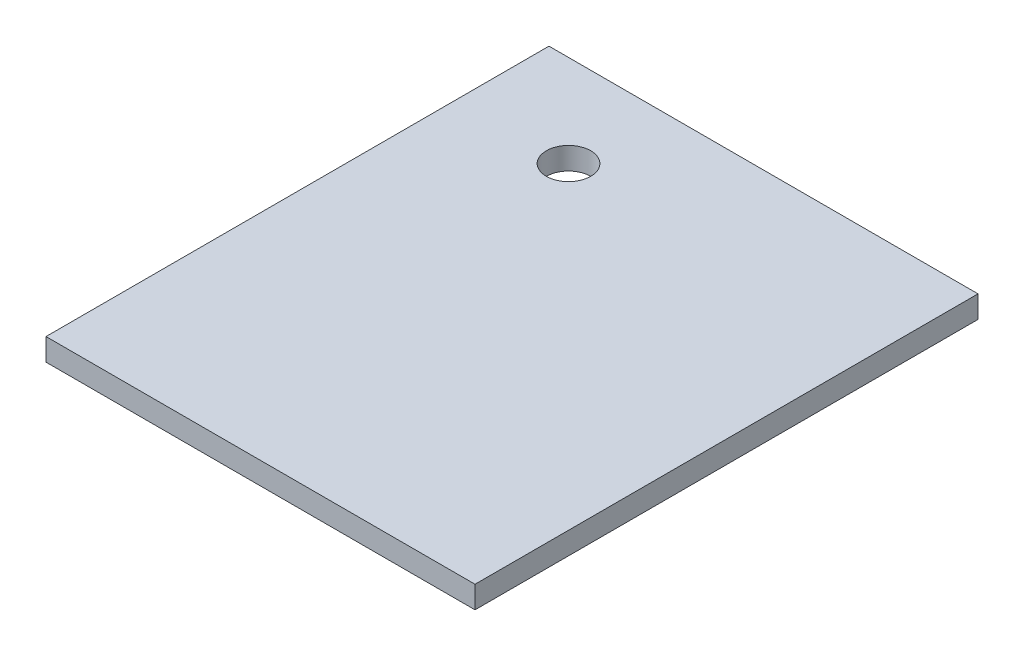
ISO-10303-21;
HEADER;
FILE_DESCRIPTION(('STEP AP214'),'2;1');
FILE_NAME('part.step','',(''),(''),'','','');
FILE_SCHEMA(('AUTOMOTIVE_DESIGN { 1 0 10303 214 1 1 1 1 }'));
ENDSEC;
DATA;
#1=APPLICATION_CONTEXT('core data for automotive mechanical design processes');
#2=APPLICATION_PROTOCOL_DEFINITION('international standard','automotive_design',2000,#1);
#3=PRODUCT_CONTEXT('',#1,'mechanical');
#4=PRODUCT('Part','Part','',(#3));
#5=PRODUCT_RELATED_PRODUCT_CATEGORY('part','',(#4));
#6=PRODUCT_DEFINITION_FORMATION('','',#4);
#7=PRODUCT_DEFINITION_CONTEXT('part definition',#1,'design');
#8=PRODUCT_DEFINITION('design','',#6,#7);
#9=PRODUCT_DEFINITION_SHAPE('','',#8);
#10=(LENGTH_UNIT() NAMED_UNIT(*) SI_UNIT(.MILLI.,.METRE.));
#11=(NAMED_UNIT(*) PLANE_ANGLE_UNIT() SI_UNIT($,.RADIAN.));
#12=(NAMED_UNIT(*) SI_UNIT($,.STERADIAN.) SOLID_ANGLE_UNIT());
#13=UNCERTAINTY_MEASURE_WITH_UNIT(LENGTH_MEASURE(1.E-05),#10,'distance_accuracy_value','');
#14=(GEOMETRIC_REPRESENTATION_CONTEXT(3) GLOBAL_UNCERTAINTY_ASSIGNED_CONTEXT((#13)) GLOBAL_UNIT_ASSIGNED_CONTEXT((#10,
#11,#12)) REPRESENTATION_CONTEXT('',''));
#15=CARTESIAN_POINT('',(0.,0.,0.));
#16=DIRECTION('',(0.,0.,1.));
#17=DIRECTION('',(1.,0.,0.));
#18=AXIS2_PLACEMENT_3D('',#15,#16,#17);
#19=CARTESIAN_POINT('',(-26.3685789469399,3.,-11.4411281551357));
#20=DIRECTION('',(1.,0.,0.));
#21=DIRECTION('',(0.,0.,-1.));
#22=AXIS2_PLACEMENT_3D('',#19,#20,#21);
#23=PLANE('',#22);
#24=DIRECTION('',(0.,0.,1.));
#25=VECTOR('',#24,1.);
#26=CARTESIAN_POINT('',(-26.3685789469399,0.,-11.4411281551357));
#27=LINE('',#26,#25);
#28=CARTESIAN_POINT('',(-26.3685789469399,0.,-11.4411281551357));
#29=VERTEX_POINT('',#28);
#30=CARTESIAN_POINT('',(-26.3685789469398,0.,56.5588718448644));
#31=VERTEX_POINT('',#30);
#32=EDGE_CURVE('E101',#29,#31,#27,.T.);
#33=ORIENTED_EDGE('',*,*,#32,.T.);
#34=DIRECTION('',(0.,-1.,0.));
#35=VECTOR('',#34,1.);
#36=CARTESIAN_POINT('',(-26.3685789469398,3.,56.5588718448644));
#37=LINE('',#36,#35);
#38=CARTESIAN_POINT('',(-26.3685789469398,3.,56.5588718448644));
#39=VERTEX_POINT('',#38);
#40=EDGE_CURVE('E11',#39,#31,#37,.T.);
#41=ORIENTED_EDGE('',*,*,#40,.F.);
#42=DIRECTION('',(0.,0.,1.));
#43=VECTOR('',#42,1.);
#44=CARTESIAN_POINT('',(-26.3685789469399,3.,-11.4411281551357));
#45=LINE('',#44,#43);
#46=CARTESIAN_POINT('',(-26.3685789469399,3.,-11.4411281551357));
#47=VERTEX_POINT('',#46);
#48=EDGE_CURVE('E89',#47,#39,#45,.T.);
#49=ORIENTED_EDGE('',*,*,#48,.F.);
#50=DIRECTION('',(0.,-1.,0.));
#51=VECTOR('',#50,1.);
#52=CARTESIAN_POINT('',(-26.3685789469399,3.,-11.4411281551357));
#53=LINE('',#52,#51);
#54=EDGE_CURVE('E97',#47,#29,#53,.T.);
#55=ORIENTED_EDGE('',*,*,#54,.T.);
#56=EDGE_LOOP('',(#33,#41,#49,#55));
#57=FACE_BOUND('',#56,.T.);
#58=ADVANCED_FACE('F38',(#57),#23,.F.);
#59=CARTESIAN_POINT('',(-26.3685789469398,3.,56.5588718448644));
#60=DIRECTION('',(0.,0.,-1.));
#61=DIRECTION('',(-1.,0.,0.));
#62=AXIS2_PLACEMENT_3D('',#59,#60,#61);
#63=PLANE('',#62);
#64=DIRECTION('',(1.,0.,0.));
#65=VECTOR('',#64,1.);
#66=CARTESIAN_POINT('',(-26.3685789469398,0.,56.5588718448644));
#67=LINE('',#66,#65);
#68=CARTESIAN_POINT('',(31.6314210530602,0.,56.5588718448644));
#69=VERTEX_POINT('',#68);
#70=EDGE_CURVE('E93',#31,#69,#67,.T.);
#71=ORIENTED_EDGE('',*,*,#70,.T.);
#72=DIRECTION('',(0.,-1.,0.));
#73=VECTOR('',#72,1.);
#74=CARTESIAN_POINT('',(31.6314210530602,3.,56.5588718448644));
#75=LINE('',#74,#73);
#76=CARTESIAN_POINT('',(31.6314210530602,3.,56.5588718448644));
#77=VERTEX_POINT('',#76);
#78=EDGE_CURVE('E46',#77,#69,#75,.T.);
#79=ORIENTED_EDGE('',*,*,#78,.F.);
#80=DIRECTION('',(1.,0.,0.));
#81=VECTOR('',#80,1.);
#82=CARTESIAN_POINT('',(-26.3685789469398,3.,56.5588718448644));
#83=LINE('',#82,#81);
#84=EDGE_CURVE('E84',#39,#77,#83,.T.);
#85=ORIENTED_EDGE('',*,*,#84,.F.);
#86=ORIENTED_EDGE('',*,*,#40,.T.);
#87=EDGE_LOOP('',(#71,#79,#85,#86));
#88=FACE_BOUND('',#87,.T.);
#89=ADVANCED_FACE('F92',(#88),#63,.F.);
#90=CARTESIAN_POINT('',(31.6314210530602,3.,-11.4411281551357));
#91=DIRECTION('',(-1.,0.,0.));
#92=DIRECTION('',(0.,0.,1.));
#93=AXIS2_PLACEMENT_3D('',#90,#91,#92);
#94=PLANE('',#93);
#95=DIRECTION('',(0.,0.,-1.));
#96=VECTOR('',#95,1.);
#97=CARTESIAN_POINT('',(31.6314210530602,0.,-11.4411281551357));
#98=LINE('',#97,#96);
#99=CARTESIAN_POINT('',(31.6314210530602,0.,-11.4411281551357));
#100=VERTEX_POINT('',#99);
#101=EDGE_CURVE('E71',#69,#100,#98,.T.);
#102=ORIENTED_EDGE('',*,*,#101,.T.);
#103=DIRECTION('',(0.,-1.,0.));
#104=VECTOR('',#103,1.);
#105=CARTESIAN_POINT('',(31.6314210530602,3.,-11.4411281551357));
#106=LINE('',#105,#104);
#107=CARTESIAN_POINT('',(31.6314210530602,3.,-11.4411281551357));
#108=VERTEX_POINT('',#107);
#109=EDGE_CURVE('E94',#108,#100,#106,.T.);
#110=ORIENTED_EDGE('',*,*,#109,.F.);
#111=DIRECTION('',(0.,0.,-1.));
#112=VECTOR('',#111,1.);
#113=CARTESIAN_POINT('',(31.6314210530602,3.,-11.4411281551357));
#114=LINE('',#113,#112);
#115=EDGE_CURVE('E87',#77,#108,#114,.T.);
#116=ORIENTED_EDGE('',*,*,#115,.F.);
#117=ORIENTED_EDGE('',*,*,#78,.T.);
#118=EDGE_LOOP('',(#102,#110,#116,#117));
#119=FACE_BOUND('',#118,.T.);
#120=ADVANCED_FACE('F95',(#119),#94,.F.);
#121=CARTESIAN_POINT('',(-26.3685789469399,3.,-11.4411281551357));
#122=DIRECTION('',(0.,0.,1.));
#123=DIRECTION('',(1.,0.,0.));
#124=AXIS2_PLACEMENT_3D('',#121,#122,#123);
#125=PLANE('',#124);
#126=DIRECTION('',(-1.,0.,0.));
#127=VECTOR('',#126,1.);
#128=CARTESIAN_POINT('',(-26.3685789469399,0.,-11.4411281551357));
#129=LINE('',#128,#127);
#130=EDGE_CURVE('E77',#100,#29,#129,.T.);
#131=ORIENTED_EDGE('',*,*,#130,.T.);
#132=ORIENTED_EDGE('',*,*,#54,.F.);
#133=DIRECTION('',(-1.,0.,0.));
#134=VECTOR('',#133,1.);
#135=CARTESIAN_POINT('',(-26.3685789469399,3.,-11.4411281551357));
#136=LINE('',#135,#134);
#137=EDGE_CURVE('E54',#108,#47,#136,.T.);
#138=ORIENTED_EDGE('',*,*,#137,.F.);
#139=ORIENTED_EDGE('',*,*,#109,.T.);
#140=EDGE_LOOP('',(#131,#132,#138,#139));
#141=FACE_BOUND('',#140,.T.);
#142=ADVANCED_FACE('F109',(#141),#125,.F.);
#143=CARTESIAN_POINT('',(0.,3.,0.));
#144=DIRECTION('',(0.,1.,0.));
#145=DIRECTION('',(0.,0.,1.));
#146=AXIS2_PLACEMENT_3D('',#143,#144,#145);
#147=PLANE('',#146);
#148=CARTESIAN_POINT('',(-11.303876487936,3.,0.981472803310499));
#149=DIRECTION('',(0.,1.,0.));
#150=DIRECTION('',(0.,0.,1.));
#151=AXIS2_PLACEMENT_3D('',#148,#149,#150);
#152=CIRCLE('',#151,3.);
#153=CARTESIAN_POINT('',(-11.303876487936,3.,3.9814728033105));
#154=VERTEX_POINT('',#153);
#155=EDGE_CURVE('E104',#154,#154,#152,.T.);
#156=ORIENTED_EDGE('',*,*,#155,.F.);
#157=EDGE_LOOP('',(#156));
#158=FACE_BOUND('',#157,.T.);
#159=ORIENTED_EDGE('',*,*,#48,.T.);
#160=ORIENTED_EDGE('',*,*,#84,.T.);
#161=ORIENTED_EDGE('',*,*,#115,.T.);
#162=ORIENTED_EDGE('',*,*,#137,.T.);
#163=EDGE_LOOP('',(#159,#160,#161,#162));
#164=FACE_BOUND('',#163,.T.);
#165=ADVANCED_FACE('F85',(#158,#164),#147,.T.);
#166=CARTESIAN_POINT('',(0.,0.,0.));
#167=DIRECTION('',(0.,1.,0.));
#168=DIRECTION('',(0.,0.,1.));
#169=AXIS2_PLACEMENT_3D('',#166,#167,#168);
#170=PLANE('',#169);
#171=CARTESIAN_POINT('',(-11.303876487936,0.,0.981472803310499));
#172=DIRECTION('',(0.,-1.,0.));
#173=DIRECTION('',(0.,0.,-1.));
#174=AXIS2_PLACEMENT_3D('',#171,#172,#173);
#175=CIRCLE('',#174,3.);
#176=CARTESIAN_POINT('',(-11.303876487936,0.,-2.0185271966895));
#177=VERTEX_POINT('',#176);
#178=EDGE_CURVE('E117',#177,#177,#175,.T.);
#179=ORIENTED_EDGE('',*,*,#178,.F.);
#180=EDGE_LOOP('',(#179));
#181=FACE_BOUND('',#180,.T.);
#182=ORIENTED_EDGE('',*,*,#32,.F.);
#183=ORIENTED_EDGE('',*,*,#130,.F.);
#184=ORIENTED_EDGE('',*,*,#101,.F.);
#185=ORIENTED_EDGE('',*,*,#70,.F.);
#186=EDGE_LOOP('',(#182,#183,#184,#185));
#187=FACE_BOUND('',#186,.T.);
#188=ADVANCED_FACE('F112',(#181,#187),#170,.F.);
#189=CARTESIAN_POINT('',(-11.303876487936,0.,0.981472803310499));
#190=DIRECTION('',(0.,-1.,0.));
#191=DIRECTION('',(0.,0.,-1.));
#192=AXIS2_PLACEMENT_3D('',#189,#190,#191);
#193=CYLINDRICAL_SURFACE('',#192,3.);
#194=ORIENTED_EDGE('',*,*,#178,.T.);
#195=EDGE_LOOP('',(#194));
#196=FACE_BOUND('',#195,.T.);
#197=ORIENTED_EDGE('',*,*,#155,.T.);
#198=EDGE_LOOP('',(#197));
#199=FACE_BOUND('',#198,.T.);
#200=ADVANCED_FACE('F121',(#196,#199),#193,.F.);
#201=CLOSED_SHELL('',(#58,#89,#120,#142,#165,#188,#200));
#202=MANIFOLD_SOLID_BREP('B2',#201);
#203=ADVANCED_BREP_SHAPE_REPRESENTATION('',(#18,#202),#14);
#204=SHAPE_DEFINITION_REPRESENTATION(#9,#203);
ENDSEC;
END-ISO-10303-21;
